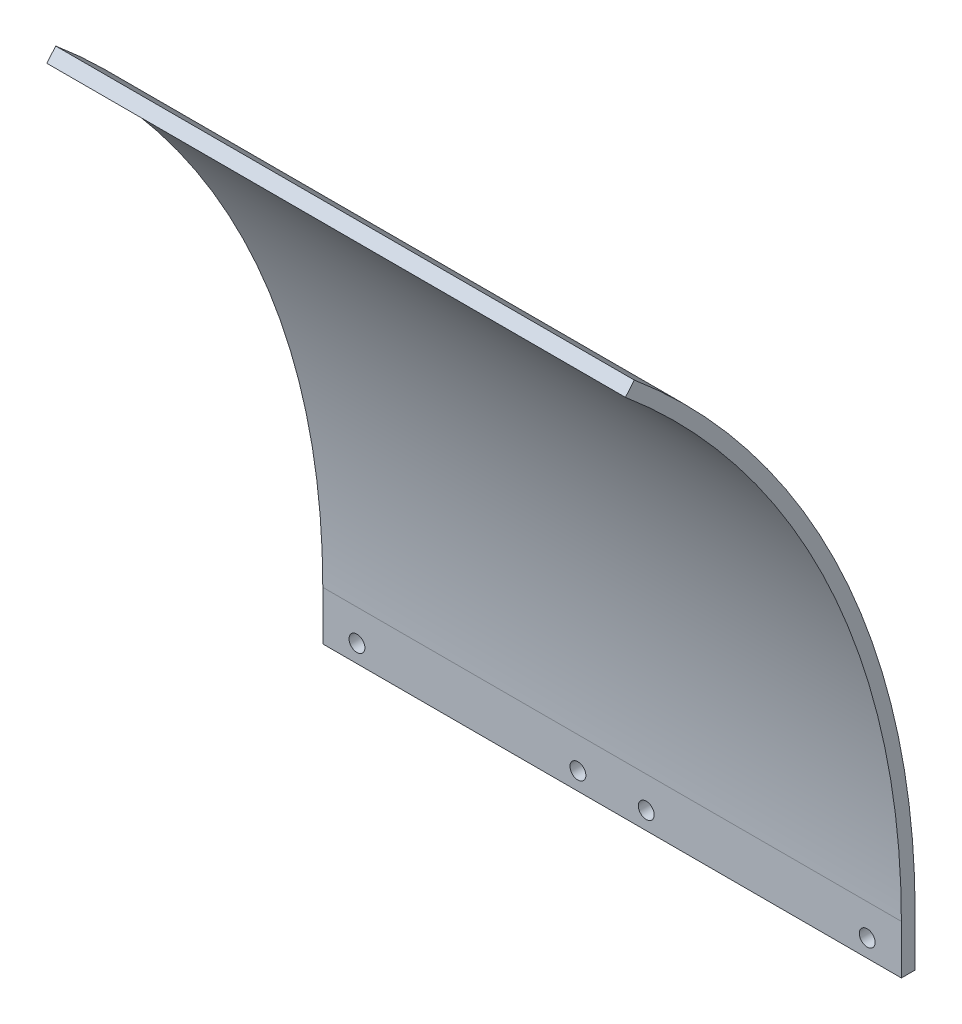
ISO-10303-21;
HEADER;
FILE_DESCRIPTION(('STEP AP214'),'2;1');
FILE_NAME('part.step','',(''),(''),'','','');
FILE_SCHEMA(('AUTOMOTIVE_DESIGN { 1 0 10303 214 1 1 1 1 }'));
ENDSEC;
DATA;
#1=APPLICATION_CONTEXT('core data for automotive mechanical design processes');
#2=APPLICATION_PROTOCOL_DEFINITION('international standard','automotive_design',2000,#1);
#3=PRODUCT_CONTEXT('',#1,'mechanical');
#4=PRODUCT('Part','Part','',(#3));
#5=PRODUCT_RELATED_PRODUCT_CATEGORY('part','',(#4));
#6=PRODUCT_DEFINITION_FORMATION('','',#4);
#7=PRODUCT_DEFINITION_CONTEXT('part definition',#1,'design');
#8=PRODUCT_DEFINITION('design','',#6,#7);
#9=PRODUCT_DEFINITION_SHAPE('','',#8);
#10=(LENGTH_UNIT() NAMED_UNIT(*) SI_UNIT(.MILLI.,.METRE.));
#11=(NAMED_UNIT(*) PLANE_ANGLE_UNIT() SI_UNIT($,.RADIAN.));
#12=(NAMED_UNIT(*) SI_UNIT($,.STERADIAN.) SOLID_ANGLE_UNIT());
#13=UNCERTAINTY_MEASURE_WITH_UNIT(LENGTH_MEASURE(1.E-05),#10,'distance_accuracy_value','');
#14=(GEOMETRIC_REPRESENTATION_CONTEXT(3) GLOBAL_UNCERTAINTY_ASSIGNED_CONTEXT((#13)) GLOBAL_UNIT_ASSIGNED_CONTEXT((#10,
#11,#12)) REPRESENTATION_CONTEXT('',''));
#15=CARTESIAN_POINT('',(0.,0.,0.));
#16=DIRECTION('',(0.,0.,1.));
#17=DIRECTION('',(1.,0.,0.));
#18=AXIS2_PLACEMENT_3D('',#15,#16,#17);
#19=CARTESIAN_POINT('',(133.35,0.,0.));
#20=DIRECTION('',(-1.,0.,0.));
#21=DIRECTION('',(0.,0.,1.));
#22=AXIS2_PLACEMENT_3D('',#19,#20,#21);
#23=CYLINDRICAL_SURFACE('',#22,178.054);
#24=CARTESIAN_POINT('',(133.35,0.,0.));
#25=DIRECTION('',(-1.,0.,0.));
#26=DIRECTION('',(0.,0.,-1.));
#27=AXIS2_PLACEMENT_3D('',#24,#25,#26);
#28=CIRCLE('',#27,178.054);
#29=CARTESIAN_POINT('',(133.35,136.397277275107,-114.450905055127));
#30=VERTEX_POINT('',#29);
#31=CARTESIAN_POINT('',(133.35,0.,-178.054));
#32=VERTEX_POINT('',#31);
#33=EDGE_CURVE('E132',#30,#32,#28,.T.);
#34=ORIENTED_EDGE('',*,*,#33,.F.);
#35=DIRECTION('',(1.,0.,0.));
#36=VECTOR('',#35,1.);
#37=CARTESIAN_POINT('',(0.,136.397277275107,-114.450905055127));
#38=LINE('',#37,#36);
#39=CARTESIAN_POINT('',(0.,136.397277275107,-114.450905055127));
#40=VERTEX_POINT('',#39);
#41=EDGE_CURVE('E75',#40,#30,#38,.T.);
#42=ORIENTED_EDGE('',*,*,#41,.F.);
#43=CARTESIAN_POINT('',(0.,0.,0.));
#44=DIRECTION('',(-1.,0.,0.));
#45=DIRECTION('',(0.,0.,-1.));
#46=AXIS2_PLACEMENT_3D('',#43,#44,#45);
#47=CIRCLE('',#46,178.054);
#48=CARTESIAN_POINT('',(0.,0.,-178.054));
#49=VERTEX_POINT('',#48);
#50=EDGE_CURVE('E100',#40,#49,#47,.T.);
#51=ORIENTED_EDGE('',*,*,#50,.T.);
#52=DIRECTION('',(-1.,0.,0.));
#53=VECTOR('',#52,1.);
#54=CARTESIAN_POINT('',(133.35,0.,-178.054));
#55=LINE('',#54,#53);
#56=EDGE_CURVE('E11',#32,#49,#55,.T.);
#57=ORIENTED_EDGE('',*,*,#56,.F.);
#58=EDGE_LOOP('',(#34,#42,#51,#57));
#59=FACE_BOUND('',#58,.T.);
#60=ADVANCED_FACE('F33',(#59),#23,.F.);
#61=CARTESIAN_POINT('',(133.35,0.,0.));
#62=DIRECTION('',(-1.,0.,0.));
#63=DIRECTION('',(0.,0.,1.));
#64=AXIS2_PLACEMENT_3D('',#61,#62,#63);
#65=CYLINDRICAL_SURFACE('',#64,181.229);
#66=CARTESIAN_POINT('',(0.,0.,0.));
#67=DIRECTION('',(1.,0.,0.));
#68=DIRECTION('',(0.,0.,-1.));
#69=AXIS2_PLACEMENT_3D('',#66,#67,#68);
#70=CIRCLE('',#69,181.229);
#71=CARTESIAN_POINT('',(0.,0.,-181.229));
#72=VERTEX_POINT('',#71);
#73=CARTESIAN_POINT('',(0.,138.829468382009,-116.491755715882));
#74=VERTEX_POINT('',#73);
#75=EDGE_CURVE('E105',#72,#74,#70,.T.);
#76=ORIENTED_EDGE('',*,*,#75,.T.);
#77=DIRECTION('',(1.,0.,0.));
#78=VECTOR('',#77,1.);
#79=CARTESIAN_POINT('',(0.,138.829468382009,-116.491755715882));
#80=LINE('',#79,#78);
#81=CARTESIAN_POINT('',(133.35,138.829468382009,-116.491755715882));
#82=VERTEX_POINT('',#81);
#83=EDGE_CURVE('E47',#74,#82,#80,.T.);
#84=ORIENTED_EDGE('',*,*,#83,.T.);
#85=CARTESIAN_POINT('',(133.35,0.,0.));
#86=DIRECTION('',(1.,0.,0.));
#87=DIRECTION('',(0.,0.,-1.));
#88=AXIS2_PLACEMENT_3D('',#85,#86,#87);
#89=CIRCLE('',#88,181.229);
#90=CARTESIAN_POINT('',(133.35,0.,-181.229));
#91=VERTEX_POINT('',#90);
#92=EDGE_CURVE('E55',#91,#82,#89,.T.);
#93=ORIENTED_EDGE('',*,*,#92,.F.);
#94=DIRECTION('',(-1.,0.,0.));
#95=VECTOR('',#94,1.);
#96=CARTESIAN_POINT('',(133.35,0.,-181.229));
#97=LINE('',#96,#95);
#98=EDGE_CURVE('E40',#91,#72,#97,.T.);
#99=ORIENTED_EDGE('',*,*,#98,.T.);
#100=EDGE_LOOP('',(#76,#84,#93,#99));
#101=FACE_BOUND('',#100,.T.);
#102=ADVANCED_FACE('F135',(#101),#65,.T.);
#103=CARTESIAN_POINT('',(133.35,0.,0.));
#104=DIRECTION('',(1.,0.,0.));
#105=DIRECTION('',(0.,0.,-1.));
#106=AXIS2_PLACEMENT_3D('',#103,#104,#105);
#107=PLANE('',#106);
#108=DIRECTION('',(0.,0.766044443118981,-0.642787609686535));
#109=VECTOR('',#108,1.);
#110=CARTESIAN_POINT('',(133.35,136.397277275107,-114.450905055127));
#111=LINE('',#110,#109);
#112=EDGE_CURVE('E127',#30,#82,#111,.T.);
#113=ORIENTED_EDGE('',*,*,#112,.F.);
#114=ORIENTED_EDGE('',*,*,#33,.T.);
#115=DIRECTION('',(0.,1.,0.));
#116=VECTOR('',#115,1.);
#117=CARTESIAN_POINT('',(133.35,-11.303,-178.054));
#118=LINE('',#117,#116);
#119=CARTESIAN_POINT('',(133.35,-11.303,-178.054));
#120=VERTEX_POINT('',#119);
#121=EDGE_CURVE('E112',#120,#32,#118,.T.);
#122=ORIENTED_EDGE('',*,*,#121,.F.);
#123=DIRECTION('',(0.,0.,1.));
#124=VECTOR('',#123,1.);
#125=CARTESIAN_POINT('',(133.35,-11.303,-181.229));
#126=LINE('',#125,#124);
#127=CARTESIAN_POINT('',(133.35,-11.303,-181.229));
#128=VERTEX_POINT('',#127);
#129=EDGE_CURVE('E119',#128,#120,#126,.T.);
#130=ORIENTED_EDGE('',*,*,#129,.F.);
#131=DIRECTION('',(0.,1.,0.));
#132=VECTOR('',#131,1.);
#133=CARTESIAN_POINT('',(133.35,-11.303,-181.229));
#134=LINE('',#133,#132);
#135=EDGE_CURVE('E117',#128,#91,#134,.T.);
#136=ORIENTED_EDGE('',*,*,#135,.T.);
#137=ORIENTED_EDGE('',*,*,#92,.T.);
#138=EDGE_LOOP('',(#113,#114,#122,#130,#136,#137));
#139=FACE_BOUND('',#138,.T.);
#140=ADVANCED_FACE('F139',(#139),#107,.T.);
#141=CARTESIAN_POINT('',(0.,0.,0.));
#142=DIRECTION('',(1.,0.,0.));
#143=DIRECTION('',(0.,0.,-1.));
#144=AXIS2_PLACEMENT_3D('',#141,#142,#143);
#145=PLANE('',#144);
#146=ORIENTED_EDGE('',*,*,#50,.F.);
#147=DIRECTION('',(0.,0.766044443118981,-0.642787609686535));
#148=VECTOR('',#147,1.);
#149=CARTESIAN_POINT('',(0.,136.397277275107,-114.450905055127));
#150=LINE('',#149,#148);
#151=EDGE_CURVE('E67',#40,#74,#150,.T.);
#152=ORIENTED_EDGE('',*,*,#151,.T.);
#153=ORIENTED_EDGE('',*,*,#75,.F.);
#154=DIRECTION('',(0.,1.,0.));
#155=VECTOR('',#154,1.);
#156=CARTESIAN_POINT('',(0.,-11.303,-181.229));
#157=LINE('',#156,#155);
#158=CARTESIAN_POINT('',(0.,-11.303,-181.229));
#159=VERTEX_POINT('',#158);
#160=EDGE_CURVE('E125',#159,#72,#157,.T.);
#161=ORIENTED_EDGE('',*,*,#160,.F.);
#162=DIRECTION('',(0.,0.,-1.));
#163=VECTOR('',#162,1.);
#164=CARTESIAN_POINT('',(0.,-11.303,-181.229));
#165=LINE('',#164,#163);
#166=CARTESIAN_POINT('',(0.,-11.303,-178.054));
#167=VERTEX_POINT('',#166);
#168=EDGE_CURVE('E115',#167,#159,#165,.T.);
#169=ORIENTED_EDGE('',*,*,#168,.F.);
#170=DIRECTION('',(0.,1.,0.));
#171=VECTOR('',#170,1.);
#172=CARTESIAN_POINT('',(0.,-11.303,-178.054));
#173=LINE('',#172,#171);
#174=EDGE_CURVE('E109',#167,#49,#173,.T.);
#175=ORIENTED_EDGE('',*,*,#174,.T.);
#176=EDGE_LOOP('',(#146,#152,#153,#161,#169,#175));
#177=FACE_BOUND('',#176,.T.);
#178=ADVANCED_FACE('F113',(#177),#145,.F.);
#179=CARTESIAN_POINT('',(0.,136.397277275107,-114.450905055127));
#180=DIRECTION('',(0.,-0.642787609686535,-0.766044443118981));
#181=DIRECTION('',(0.,0.766044443118981,-0.642787609686535));
#182=AXIS2_PLACEMENT_3D('',#179,#180,#181);
#183=PLANE('',#182);
#184=ORIENTED_EDGE('',*,*,#112,.T.);
#185=ORIENTED_EDGE('',*,*,#83,.F.);
#186=ORIENTED_EDGE('',*,*,#151,.F.);
#187=ORIENTED_EDGE('',*,*,#41,.T.);
#188=EDGE_LOOP('',(#184,#185,#186,#187));
#189=FACE_BOUND('',#188,.T.);
#190=ADVANCED_FACE('F212',(#189),#183,.F.);
#191=CARTESIAN_POINT('',(0.,-11.303,-181.229));
#192=DIRECTION('',(0.,0.,1.));
#193=DIRECTION('',(1.,0.,0.));
#194=AXIS2_PLACEMENT_3D('',#191,#192,#193);
#195=PLANE('',#194);
#196=CARTESIAN_POINT('',(125.476,-7.239,-181.229));
#197=DIRECTION('',(0.,0.,1.));
#198=DIRECTION('',(-1.,0.,0.));
#199=AXIS2_PLACEMENT_3D('',#196,#197,#198);
#200=CIRCLE('',#199,1.8288);
#201=CARTESIAN_POINT('',(123.6472,-7.239,-181.229));
#202=VERTEX_POINT('',#201);
#203=EDGE_CURVE('E159',#202,#202,#200,.T.);
#204=ORIENTED_EDGE('',*,*,#203,.T.);
#205=EDGE_LOOP('',(#204));
#206=FACE_BOUND('',#205,.T.);
#207=CARTESIAN_POINT('',(74.549,-7.23899999999999,-181.229));
#208=DIRECTION('',(0.,0.,1.));
#209=DIRECTION('',(-1.,0.,0.));
#210=AXIS2_PLACEMENT_3D('',#207,#208,#209);
#211=CIRCLE('',#210,1.82880000000001);
#212=CARTESIAN_POINT('',(72.7202,-7.23899999999999,-181.229));
#213=VERTEX_POINT('',#212);
#214=EDGE_CURVE('E153',#213,#213,#211,.T.);
#215=ORIENTED_EDGE('',*,*,#214,.T.);
#216=EDGE_LOOP('',(#215));
#217=FACE_BOUND('',#216,.T.);
#218=CARTESIAN_POINT('',(58.801,-7.23899999999999,-181.229));
#219=DIRECTION('',(0.,0.,1.));
#220=DIRECTION('',(1.,0.,0.));
#221=AXIS2_PLACEMENT_3D('',#218,#219,#220);
#222=CIRCLE('',#221,1.8288);
#223=CARTESIAN_POINT('',(60.6298,-7.23899999999999,-181.229));
#224=VERTEX_POINT('',#223);
#225=EDGE_CURVE('E147',#224,#224,#222,.T.);
#226=ORIENTED_EDGE('',*,*,#225,.T.);
#227=EDGE_LOOP('',(#226));
#228=FACE_BOUND('',#227,.T.);
#229=CARTESIAN_POINT('',(7.874,-7.239,-181.229));
#230=DIRECTION('',(0.,0.,1.));
#231=DIRECTION('',(1.,0.,0.));
#232=AXIS2_PLACEMENT_3D('',#229,#230,#231);
#233=CIRCLE('',#232,1.8288);
#234=CARTESIAN_POINT('',(9.7028,-7.239,-181.229));
#235=VERTEX_POINT('',#234);
#236=EDGE_CURVE('E143',#235,#235,#233,.T.);
#237=ORIENTED_EDGE('',*,*,#236,.T.);
#238=EDGE_LOOP('',(#237));
#239=FACE_BOUND('',#238,.T.);
#240=ORIENTED_EDGE('',*,*,#98,.F.);
#241=ORIENTED_EDGE('',*,*,#135,.F.);
#242=DIRECTION('',(1.,0.,0.));
#243=VECTOR('',#242,1.);
#244=CARTESIAN_POINT('',(0.,-11.303,-181.229));
#245=LINE('',#244,#243);
#246=EDGE_CURVE('E95',#159,#128,#245,.T.);
#247=ORIENTED_EDGE('',*,*,#246,.F.);
#248=ORIENTED_EDGE('',*,*,#160,.T.);
#249=EDGE_LOOP('',(#240,#241,#247,#248));
#250=FACE_BOUND('',#249,.T.);
#251=ADVANCED_FACE('F136',(#206,#217,#228,#239,#250),#195,.F.);
#252=CARTESIAN_POINT('',(0.,-11.303,-178.054));
#253=DIRECTION('',(0.,0.,-1.));
#254=DIRECTION('',(-1.,0.,0.));
#255=AXIS2_PLACEMENT_3D('',#252,#253,#254);
#256=PLANE('',#255);
#257=CARTESIAN_POINT('',(125.476,-7.239,-178.054));
#258=DIRECTION('',(0.,0.,1.));
#259=DIRECTION('',(-1.,0.,0.));
#260=AXIS2_PLACEMENT_3D('',#257,#258,#259);
#261=CIRCLE('',#260,1.8288);
#262=CARTESIAN_POINT('',(123.6472,-7.239,-178.054));
#263=VERTEX_POINT('',#262);
#264=EDGE_CURVE('E162',#263,#263,#261,.T.);
#265=ORIENTED_EDGE('',*,*,#264,.F.);
#266=EDGE_LOOP('',(#265));
#267=FACE_BOUND('',#266,.T.);
#268=CARTESIAN_POINT('',(74.549,-7.23899999999999,-178.054));
#269=DIRECTION('',(0.,0.,1.));
#270=DIRECTION('',(-1.,0.,0.));
#271=AXIS2_PLACEMENT_3D('',#268,#269,#270);
#272=CIRCLE('',#271,1.82880000000001);
#273=CARTESIAN_POINT('',(72.7202,-7.23899999999999,-178.054));
#274=VERTEX_POINT('',#273);
#275=EDGE_CURVE('E156',#274,#274,#272,.T.);
#276=ORIENTED_EDGE('',*,*,#275,.F.);
#277=EDGE_LOOP('',(#276));
#278=FACE_BOUND('',#277,.T.);
#279=CARTESIAN_POINT('',(58.801,-7.23899999999999,-178.054));
#280=DIRECTION('',(0.,0.,1.));
#281=DIRECTION('',(1.,0.,0.));
#282=AXIS2_PLACEMENT_3D('',#279,#280,#281);
#283=CIRCLE('',#282,1.8288);
#284=CARTESIAN_POINT('',(60.6298,-7.23899999999999,-178.054));
#285=VERTEX_POINT('',#284);
#286=EDGE_CURVE('E150',#285,#285,#283,.T.);
#287=ORIENTED_EDGE('',*,*,#286,.F.);
#288=EDGE_LOOP('',(#287));
#289=FACE_BOUND('',#288,.T.);
#290=CARTESIAN_POINT('',(7.874,-7.239,-178.054));
#291=DIRECTION('',(0.,0.,1.));
#292=DIRECTION('',(1.,0.,0.));
#293=AXIS2_PLACEMENT_3D('',#290,#291,#292);
#294=CIRCLE('',#293,1.8288);
#295=CARTESIAN_POINT('',(9.7028,-7.239,-178.054));
#296=VERTEX_POINT('',#295);
#297=EDGE_CURVE('E144',#296,#296,#294,.T.);
#298=ORIENTED_EDGE('',*,*,#297,.F.);
#299=EDGE_LOOP('',(#298));
#300=FACE_BOUND('',#299,.T.);
#301=ORIENTED_EDGE('',*,*,#56,.T.);
#302=ORIENTED_EDGE('',*,*,#174,.F.);
#303=DIRECTION('',(-1.,0.,0.));
#304=VECTOR('',#303,1.);
#305=CARTESIAN_POINT('',(0.,-11.303,-178.054));
#306=LINE('',#305,#304);
#307=EDGE_CURVE('E83',#120,#167,#306,.T.);
#308=ORIENTED_EDGE('',*,*,#307,.F.);
#309=ORIENTED_EDGE('',*,*,#121,.T.);
#310=EDGE_LOOP('',(#301,#302,#308,#309));
#311=FACE_BOUND('',#310,.T.);
#312=ADVANCED_FACE('F108',(#267,#278,#289,#300,#311),#256,.F.);
#313=CARTESIAN_POINT('',(0.,-11.303,0.));
#314=DIRECTION('',(0.,1.,0.));
#315=DIRECTION('',(0.,0.,1.));
#316=AXIS2_PLACEMENT_3D('',#313,#314,#315);
#317=PLANE('',#316);
#318=ORIENTED_EDGE('',*,*,#168,.T.);
#319=ORIENTED_EDGE('',*,*,#246,.T.);
#320=ORIENTED_EDGE('',*,*,#129,.T.);
#321=ORIENTED_EDGE('',*,*,#307,.T.);
#322=EDGE_LOOP('',(#318,#319,#320,#321));
#323=FACE_BOUND('',#322,.T.);
#324=ADVANCED_FACE('F179',(#323),#317,.F.);
#325=CARTESIAN_POINT('',(7.874,-7.239,-181.229));
#326=DIRECTION('',(0.,0.,1.));
#327=DIRECTION('',(1.,0.,0.));
#328=AXIS2_PLACEMENT_3D('',#325,#326,#327);
#329=CYLINDRICAL_SURFACE('',#328,1.8288);
#330=ORIENTED_EDGE('',*,*,#236,.F.);
#331=EDGE_LOOP('',(#330));
#332=FACE_BOUND('',#331,.T.);
#333=ORIENTED_EDGE('',*,*,#297,.T.);
#334=EDGE_LOOP('',(#333));
#335=FACE_BOUND('',#334,.T.);
#336=ADVANCED_FACE('F187',(#332,#335),#329,.F.);
#337=CARTESIAN_POINT('',(58.801,-7.23899999999999,-181.229));
#338=DIRECTION('',(0.,0.,1.));
#339=DIRECTION('',(1.,0.,0.));
#340=AXIS2_PLACEMENT_3D('',#337,#338,#339);
#341=CYLINDRICAL_SURFACE('',#340,1.8288);
#342=ORIENTED_EDGE('',*,*,#225,.F.);
#343=EDGE_LOOP('',(#342));
#344=FACE_BOUND('',#343,.T.);
#345=ORIENTED_EDGE('',*,*,#286,.T.);
#346=EDGE_LOOP('',(#345));
#347=FACE_BOUND('',#346,.T.);
#348=ADVANCED_FACE('F189',(#344,#347),#341,.F.);
#349=CARTESIAN_POINT('',(74.549,-7.23899999999999,-181.229));
#350=DIRECTION('',(0.,0.,1.));
#351=DIRECTION('',(1.,0.,0.));
#352=AXIS2_PLACEMENT_3D('',#349,#350,#351);
#353=CYLINDRICAL_SURFACE('',#352,1.82880000000001);
#354=ORIENTED_EDGE('',*,*,#214,.F.);
#355=EDGE_LOOP('',(#354));
#356=FACE_BOUND('',#355,.T.);
#357=ORIENTED_EDGE('',*,*,#275,.T.);
#358=EDGE_LOOP('',(#357));
#359=FACE_BOUND('',#358,.T.);
#360=ADVANCED_FACE('F173',(#356,#359),#353,.F.);
#361=CARTESIAN_POINT('',(125.476,-7.239,-181.229));
#362=DIRECTION('',(0.,0.,1.));
#363=DIRECTION('',(1.,0.,0.));
#364=AXIS2_PLACEMENT_3D('',#361,#362,#363);
#365=CYLINDRICAL_SURFACE('',#364,1.8288);
#366=ORIENTED_EDGE('',*,*,#203,.F.);
#367=EDGE_LOOP('',(#366));
#368=FACE_BOUND('',#367,.T.);
#369=ORIENTED_EDGE('',*,*,#264,.T.);
#370=EDGE_LOOP('',(#369));
#371=FACE_BOUND('',#370,.T.);
#372=ADVANCED_FACE('F170',(#368,#371),#365,.F.);
#373=CLOSED_SHELL('',(#60,#102,#140,#178,#190,#251,#312,#324,#336,#348,#360,#372));
#374=MANIFOLD_SOLID_BREP('B2',#373);
#375=ADVANCED_BREP_SHAPE_REPRESENTATION('',(#18,#374),#14);
#376=SHAPE_DEFINITION_REPRESENTATION(#9,#375);
ENDSEC;
END-ISO-10303-21;
